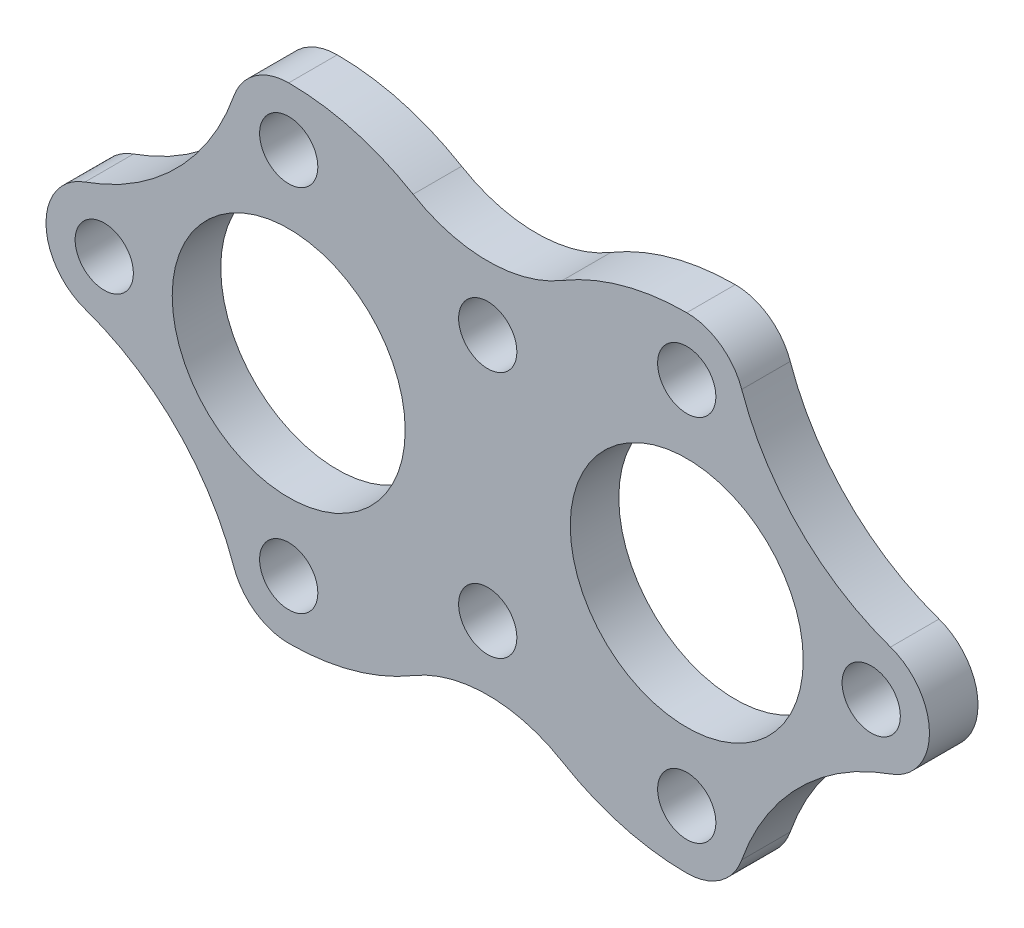
ISO-10303-21;
HEADER;
FILE_DESCRIPTION(('STEP AP214'),'2;1');
FILE_NAME('part.step','',(''),(''),'','','');
FILE_SCHEMA(('AUTOMOTIVE_DESIGN { 1 0 10303 214 1 1 1 1 }'));
ENDSEC;
DATA;
#1=APPLICATION_CONTEXT('core data for automotive mechanical design processes');
#2=APPLICATION_PROTOCOL_DEFINITION('international standard','automotive_design',2000,#1);
#3=PRODUCT_CONTEXT('',#1,'mechanical');
#4=PRODUCT('Part','Part','',(#3));
#5=PRODUCT_RELATED_PRODUCT_CATEGORY('part','',(#4));
#6=PRODUCT_DEFINITION_FORMATION('','',#4);
#7=PRODUCT_DEFINITION_CONTEXT('part definition',#1,'design');
#8=PRODUCT_DEFINITION('design','',#6,#7);
#9=PRODUCT_DEFINITION_SHAPE('','',#8);
#10=(LENGTH_UNIT() NAMED_UNIT(*) SI_UNIT(.MILLI.,.METRE.));
#11=(NAMED_UNIT(*) PLANE_ANGLE_UNIT() SI_UNIT($,.RADIAN.));
#12=(NAMED_UNIT(*) SI_UNIT($,.STERADIAN.) SOLID_ANGLE_UNIT());
#13=UNCERTAINTY_MEASURE_WITH_UNIT(LENGTH_MEASURE(1.E-05),#10,'distance_accuracy_value','');
#14=(GEOMETRIC_REPRESENTATION_CONTEXT(3) GLOBAL_UNCERTAINTY_ASSIGNED_CONTEXT((#13)) GLOBAL_UNIT_ASSIGNED_CONTEXT((#10,
#11,#12)) REPRESENTATION_CONTEXT('',''));
#15=CARTESIAN_POINT('',(0.,0.,0.));
#16=DIRECTION('',(0.,0.,1.));
#17=DIRECTION('',(1.,0.,0.));
#18=AXIS2_PLACEMENT_3D('',#15,#16,#17);
#19=CARTESIAN_POINT('',(-41.,0.,10.));
#20=DIRECTION('',(0.,0.,-1.));
#21=DIRECTION('',(-1.,0.,0.));
#22=AXIS2_PLACEMENT_3D('',#19,#20,#21);
#23=CYLINDRICAL_SURFACE('',#22,50.);
#24=CARTESIAN_POINT('',(-41.,0.,0.));
#25=DIRECTION('',(0.,0.,1.));
#26=DIRECTION('',(1.,0.,0.));
#27=AXIS2_PLACEMENT_3D('',#24,#25,#26);
#28=CIRCLE('',#27,50.);
#29=CARTESIAN_POINT('',(-41.,50.,0.));
#30=VERTEX_POINT('',#29);
#31=CARTESIAN_POINT('',(-15.375,42.934361238989,0.));
#32=VERTEX_POINT('',#31);
#33=EDGE_CURVE('E210',#30,#32,#28,.F.);
#34=ORIENTED_EDGE('',*,*,#33,.F.);
#35=DIRECTION('',(0.,0.,-1.));
#36=VECTOR('',#35,1.);
#37=CARTESIAN_POINT('',(-41.,50.,10.));
#38=LINE('',#37,#36);
#39=CARTESIAN_POINT('',(-41.,50.,10.));
#40=VERTEX_POINT('',#39);
#41=EDGE_CURVE('E11',#40,#30,#38,.T.);
#42=ORIENTED_EDGE('',*,*,#41,.F.);
#43=CARTESIAN_POINT('',(-41.,0.,10.));
#44=DIRECTION('',(0.,0.,1.));
#45=DIRECTION('',(1.,0.,0.));
#46=AXIS2_PLACEMENT_3D('',#43,#44,#45);
#47=CIRCLE('',#46,50.);
#48=CARTESIAN_POINT('',(-15.375,42.934361238989,10.));
#49=VERTEX_POINT('',#48);
#50=EDGE_CURVE('E281',#40,#49,#47,.F.);
#51=ORIENTED_EDGE('',*,*,#50,.T.);
#52=DIRECTION('',(0.,0.,-1.));
#53=VECTOR('',#52,1.);
#54=CARTESIAN_POINT('',(-15.375,42.934361238989,10.));
#55=LINE('',#54,#53);
#56=EDGE_CURVE('E55',#49,#32,#55,.T.);
#57=ORIENTED_EDGE('',*,*,#56,.T.);
#58=EDGE_LOOP('',(#34,#42,#51,#57));
#59=FACE_BOUND('',#58,.T.);
#60=ADVANCED_FACE('F39',(#59),#23,.T.);
#61=CARTESIAN_POINT('',(-41.,38.,10.));
#62=DIRECTION('',(0.,0.,-1.));
#63=DIRECTION('',(-1.,0.,0.));
#64=AXIS2_PLACEMENT_3D('',#61,#62,#63);
#65=CYLINDRICAL_SURFACE('',#64,12.);
#66=CARTESIAN_POINT('',(-41.,38.,0.));
#67=DIRECTION('',(0.,0.,1.));
#68=DIRECTION('',(1.,0.,0.));
#69=AXIS2_PLACEMENT_3D('',#66,#67,#68);
#70=CIRCLE('',#69,12.);
#71=CARTESIAN_POINT('',(-52.3244179090858,41.9695791994084,0.));
#72=VERTEX_POINT('',#71);
#73=EDGE_CURVE('E212',#72,#30,#70,.F.);
#74=ORIENTED_EDGE('',*,*,#73,.F.);
#75=DIRECTION('',(0.,0.,-1.));
#76=VECTOR('',#75,1.);
#77=CARTESIAN_POINT('',(-52.3244179090858,41.9695791994084,10.));
#78=LINE('',#77,#76);
#79=CARTESIAN_POINT('',(-52.3244179090858,41.9695791994084,10.));
#80=VERTEX_POINT('',#79);
#81=EDGE_CURVE('E47',#80,#72,#78,.T.);
#82=ORIENTED_EDGE('',*,*,#81,.F.);
#83=CARTESIAN_POINT('',(-41.,38.,10.));
#84=DIRECTION('',(0.,0.,1.));
#85=DIRECTION('',(1.,0.,0.));
#86=AXIS2_PLACEMENT_3D('',#83,#84,#85);
#87=CIRCLE('',#86,12.);
#88=EDGE_CURVE('E322',#80,#40,#87,.F.);
#89=ORIENTED_EDGE('',*,*,#88,.T.);
#90=ORIENTED_EDGE('',*,*,#41,.T.);
#91=EDGE_LOOP('',(#74,#82,#89,#90));
#92=FACE_BOUND('',#91,.T.);
#93=ADVANCED_FACE('F321',(#92),#65,.T.);
#94=CARTESIAN_POINT('',(-99.5094925302768,58.5094925302768,10.));
#95=DIRECTION('',(0.,0.,-1.));
#96=DIRECTION('',(-1.,0.,0.));
#97=AXIS2_PLACEMENT_3D('',#94,#95,#96);
#98=CYLINDRICAL_SURFACE('',#97,50.);
#99=CARTESIAN_POINT('',(-99.5094925302768,58.5094925302768,0.));
#100=DIRECTION('',(0.,0.,1.));
#101=DIRECTION('',(1.,0.,0.));
#102=AXIS2_PLACEMENT_3D('',#99,#100,#101);
#103=CIRCLE('',#102,50.);
#104=CARTESIAN_POINT('',(-82.9695791994084,11.3244179090858,0.));
#105=VERTEX_POINT('',#104);
#106=EDGE_CURVE('E215',#72,#105,#103,.F.);
#107=ORIENTED_EDGE('',*,*,#106,.T.);
#108=DIRECTION('',(0.,0.,-1.));
#109=VECTOR('',#108,1.);
#110=CARTESIAN_POINT('',(-82.9695791994084,11.3244179090858,10.));
#111=LINE('',#110,#109);
#112=CARTESIAN_POINT('',(-82.9695791994084,11.3244179090858,10.));
#113=VERTEX_POINT('',#112);
#114=EDGE_CURVE('E306',#113,#105,#111,.T.);
#115=ORIENTED_EDGE('',*,*,#114,.F.);
#116=CARTESIAN_POINT('',(-99.5094925302768,58.5094925302768,10.));
#117=DIRECTION('',(0.,0.,1.));
#118=DIRECTION('',(1.,0.,0.));
#119=AXIS2_PLACEMENT_3D('',#116,#117,#118);
#120=CIRCLE('',#119,50.);
#121=EDGE_CURVE('E312',#80,#113,#120,.F.);
#122=ORIENTED_EDGE('',*,*,#121,.F.);
#123=ORIENTED_EDGE('',*,*,#81,.T.);
#124=EDGE_LOOP('',(#107,#115,#122,#123));
#125=FACE_BOUND('',#124,.T.);
#126=ADVANCED_FACE('F310',(#125),#98,.F.);
#127=CARTESIAN_POINT('',(-79.,0.,10.));
#128=DIRECTION('',(0.,0.,-1.));
#129=DIRECTION('',(-1.,0.,0.));
#130=AXIS2_PLACEMENT_3D('',#127,#128,#129);
#131=CYLINDRICAL_SURFACE('',#130,12.);
#132=CARTESIAN_POINT('',(-79.,0.,0.));
#133=DIRECTION('',(0.,0.,1.));
#134=DIRECTION('',(1.,0.,0.));
#135=AXIS2_PLACEMENT_3D('',#132,#133,#134);
#136=CIRCLE('',#135,12.);
#137=CARTESIAN_POINT('',(-82.9695791994084,-11.3244179090858,0.));
#138=VERTEX_POINT('',#137);
#139=EDGE_CURVE('E218',#138,#105,#136,.F.);
#140=ORIENTED_EDGE('',*,*,#139,.F.);
#141=DIRECTION('',(0.,0.,-1.));
#142=VECTOR('',#141,1.);
#143=CARTESIAN_POINT('',(-82.9695791994084,-11.3244179090858,10.));
#144=LINE('',#143,#142);
#145=CARTESIAN_POINT('',(-82.9695791994084,-11.3244179090858,10.));
#146=VERTEX_POINT('',#145);
#147=EDGE_CURVE('E304',#146,#138,#144,.T.);
#148=ORIENTED_EDGE('',*,*,#147,.F.);
#149=CARTESIAN_POINT('',(-79.,0.,10.));
#150=DIRECTION('',(0.,0.,1.));
#151=DIRECTION('',(1.,0.,0.));
#152=AXIS2_PLACEMENT_3D('',#149,#150,#151);
#153=CIRCLE('',#152,12.);
#154=EDGE_CURVE('E665',#146,#113,#153,.F.);
#155=ORIENTED_EDGE('',*,*,#154,.T.);
#156=ORIENTED_EDGE('',*,*,#114,.T.);
#157=EDGE_LOOP('',(#140,#148,#155,#156));
#158=FACE_BOUND('',#157,.T.);
#159=ADVANCED_FACE('F345',(#158),#131,.T.);
#160=CARTESIAN_POINT('',(-99.5094925302768,-58.5094925302768,10.));
#161=DIRECTION('',(0.,0.,-1.));
#162=DIRECTION('',(-1.,0.,0.));
#163=AXIS2_PLACEMENT_3D('',#160,#161,#162);
#164=CYLINDRICAL_SURFACE('',#163,50.);
#165=CARTESIAN_POINT('',(-99.5094925302768,-58.5094925302768,0.));
#166=DIRECTION('',(0.,0.,1.));
#167=DIRECTION('',(1.,0.,0.));
#168=AXIS2_PLACEMENT_3D('',#165,#166,#167);
#169=CIRCLE('',#168,50.);
#170=CARTESIAN_POINT('',(-52.3244179090858,-41.9695791994084,0.));
#171=VERTEX_POINT('',#170);
#172=EDGE_CURVE('E221',#171,#138,#169,.T.);
#173=ORIENTED_EDGE('',*,*,#172,.F.);
#174=DIRECTION('',(0.,0.,-1.));
#175=VECTOR('',#174,1.);
#176=CARTESIAN_POINT('',(-52.3244179090858,-41.9695791994084,10.));
#177=LINE('',#176,#175);
#178=CARTESIAN_POINT('',(-52.3244179090858,-41.9695791994084,10.));
#179=VERTEX_POINT('',#178);
#180=EDGE_CURVE('E302',#179,#171,#177,.T.);
#181=ORIENTED_EDGE('',*,*,#180,.F.);
#182=CARTESIAN_POINT('',(-99.5094925302768,-58.5094925302768,10.));
#183=DIRECTION('',(0.,0.,1.));
#184=DIRECTION('',(1.,0.,0.));
#185=AXIS2_PLACEMENT_3D('',#182,#183,#184);
#186=CIRCLE('',#185,50.);
#187=EDGE_CURVE('E662',#179,#146,#186,.T.);
#188=ORIENTED_EDGE('',*,*,#187,.T.);
#189=ORIENTED_EDGE('',*,*,#147,.T.);
#190=EDGE_LOOP('',(#173,#181,#188,#189));
#191=FACE_BOUND('',#190,.T.);
#192=ADVANCED_FACE('F350',(#191),#164,.F.);
#193=CARTESIAN_POINT('',(-41.,-38.,10.));
#194=DIRECTION('',(0.,0.,-1.));
#195=DIRECTION('',(-1.,0.,0.));
#196=AXIS2_PLACEMENT_3D('',#193,#194,#195);
#197=CYLINDRICAL_SURFACE('',#196,12.);
#198=CARTESIAN_POINT('',(-41.,-38.,0.));
#199=DIRECTION('',(0.,0.,1.));
#200=DIRECTION('',(1.,0.,0.));
#201=AXIS2_PLACEMENT_3D('',#198,#199,#200);
#202=CIRCLE('',#201,12.);
#203=CARTESIAN_POINT('',(-41.,-50.,0.));
#204=VERTEX_POINT('',#203);
#205=EDGE_CURVE('E224',#171,#204,#202,.T.);
#206=ORIENTED_EDGE('',*,*,#205,.T.);
#207=DIRECTION('',(0.,0.,-1.));
#208=VECTOR('',#207,1.);
#209=CARTESIAN_POINT('',(-41.,-50.,10.));
#210=LINE('',#209,#208);
#211=CARTESIAN_POINT('',(-41.,-50.,10.));
#212=VERTEX_POINT('',#211);
#213=EDGE_CURVE('E299',#212,#204,#210,.T.);
#214=ORIENTED_EDGE('',*,*,#213,.F.);
#215=CARTESIAN_POINT('',(-41.,-38.,10.));
#216=DIRECTION('',(0.,0.,1.));
#217=DIRECTION('',(1.,0.,0.));
#218=AXIS2_PLACEMENT_3D('',#215,#216,#217);
#219=CIRCLE('',#218,12.);
#220=EDGE_CURVE('E667',#179,#212,#219,.T.);
#221=ORIENTED_EDGE('',*,*,#220,.F.);
#222=ORIENTED_EDGE('',*,*,#180,.T.);
#223=EDGE_LOOP('',(#206,#214,#221,#222));
#224=FACE_BOUND('',#223,.T.);
#225=ADVANCED_FACE('F354',(#224),#197,.T.);
#226=CARTESIAN_POINT('',(-41.,0.,10.));
#227=DIRECTION('',(0.,0.,-1.));
#228=DIRECTION('',(-1.,0.,0.));
#229=AXIS2_PLACEMENT_3D('',#226,#227,#228);
#230=CYLINDRICAL_SURFACE('',#229,50.);
#231=CARTESIAN_POINT('',(-41.,0.,0.));
#232=DIRECTION('',(0.,0.,1.));
#233=DIRECTION('',(1.,0.,0.));
#234=AXIS2_PLACEMENT_3D('',#231,#232,#233);
#235=CIRCLE('',#234,50.);
#236=CARTESIAN_POINT('',(-15.375,-42.934361238989,0.));
#237=VERTEX_POINT('',#236);
#238=EDGE_CURVE('E226',#204,#237,#235,.T.);
#239=ORIENTED_EDGE('',*,*,#238,.T.);
#240=DIRECTION('',(0.,0.,-1.));
#241=VECTOR('',#240,1.);
#242=CARTESIAN_POINT('',(-15.375,-42.934361238989,10.));
#243=LINE('',#242,#241);
#244=CARTESIAN_POINT('',(-15.375,-42.934361238989,10.));
#245=VERTEX_POINT('',#244);
#246=EDGE_CURVE('E296',#245,#237,#243,.T.);
#247=ORIENTED_EDGE('',*,*,#246,.F.);
#248=CARTESIAN_POINT('',(-41.,0.,10.));
#249=DIRECTION('',(0.,0.,1.));
#250=DIRECTION('',(1.,0.,0.));
#251=AXIS2_PLACEMENT_3D('',#248,#249,#250);
#252=CIRCLE('',#251,50.);
#253=EDGE_CURVE('E655',#212,#245,#252,.T.);
#254=ORIENTED_EDGE('',*,*,#253,.F.);
#255=ORIENTED_EDGE('',*,*,#213,.T.);
#256=EDGE_LOOP('',(#239,#247,#254,#255));
#257=FACE_BOUND('',#256,.T.);
#258=ADVANCED_FACE('F358',(#257),#230,.T.);
#259=CARTESIAN_POINT('',(0.,-68.6949779823824,10.));
#260=DIRECTION('',(0.,0.,-1.));
#261=DIRECTION('',(-1.,0.,0.));
#262=AXIS2_PLACEMENT_3D('',#259,#260,#261);
#263=CYLINDRICAL_SURFACE('',#262,30.);
#264=CARTESIAN_POINT('',(0.,-68.6949779823824,0.));
#265=DIRECTION('',(0.,0.,1.));
#266=DIRECTION('',(1.,0.,0.));
#267=AXIS2_PLACEMENT_3D('',#264,#265,#266);
#268=CIRCLE('',#267,30.);
#269=CARTESIAN_POINT('',(15.375,-42.934361238989,0.));
#270=VERTEX_POINT('',#269);
#271=EDGE_CURVE('E228',#237,#270,#268,.F.);
#272=ORIENTED_EDGE('',*,*,#271,.T.);
#273=DIRECTION('',(0.,0.,-1.));
#274=VECTOR('',#273,1.);
#275=CARTESIAN_POINT('',(15.375,-42.934361238989,10.));
#276=LINE('',#275,#274);
#277=CARTESIAN_POINT('',(15.375,-42.934361238989,10.));
#278=VERTEX_POINT('',#277);
#279=EDGE_CURVE('E294',#278,#270,#276,.T.);
#280=ORIENTED_EDGE('',*,*,#279,.F.);
#281=CARTESIAN_POINT('',(0.,-68.6949779823824,10.));
#282=DIRECTION('',(0.,0.,1.));
#283=DIRECTION('',(1.,0.,0.));
#284=AXIS2_PLACEMENT_3D('',#281,#282,#283);
#285=CIRCLE('',#284,30.);
#286=EDGE_CURVE('E653',#245,#278,#285,.F.);
#287=ORIENTED_EDGE('',*,*,#286,.F.);
#288=ORIENTED_EDGE('',*,*,#246,.T.);
#289=EDGE_LOOP('',(#272,#280,#287,#288));
#290=FACE_BOUND('',#289,.T.);
#291=ADVANCED_FACE('F362',(#290),#263,.F.);
#292=CARTESIAN_POINT('',(41.,0.,10.));
#293=DIRECTION('',(0.,0.,-1.));
#294=DIRECTION('',(-1.,0.,0.));
#295=AXIS2_PLACEMENT_3D('',#292,#293,#294);
#296=CYLINDRICAL_SURFACE('',#295,50.);
#297=CARTESIAN_POINT('',(41.,0.,0.));
#298=DIRECTION('',(0.,0.,1.));
#299=DIRECTION('',(1.,0.,0.));
#300=AXIS2_PLACEMENT_3D('',#297,#298,#299);
#301=CIRCLE('',#300,50.);
#302=CARTESIAN_POINT('',(41.,-50.,0.));
#303=VERTEX_POINT('',#302);
#304=EDGE_CURVE('E231',#303,#270,#301,.F.);
#305=ORIENTED_EDGE('',*,*,#304,.F.);
#306=DIRECTION('',(0.,0.,-1.));
#307=VECTOR('',#306,1.);
#308=CARTESIAN_POINT('',(41.,-50.,10.));
#309=LINE('',#308,#307);
#310=CARTESIAN_POINT('',(41.,-50.,10.));
#311=VERTEX_POINT('',#310);
#312=EDGE_CURVE('E292',#311,#303,#309,.T.);
#313=ORIENTED_EDGE('',*,*,#312,.F.);
#314=CARTESIAN_POINT('',(41.,0.,10.));
#315=DIRECTION('',(0.,0.,1.));
#316=DIRECTION('',(1.,0.,0.));
#317=AXIS2_PLACEMENT_3D('',#314,#315,#316);
#318=CIRCLE('',#317,50.);
#319=EDGE_CURVE('E650',#311,#278,#318,.F.);
#320=ORIENTED_EDGE('',*,*,#319,.T.);
#321=ORIENTED_EDGE('',*,*,#279,.T.);
#322=EDGE_LOOP('',(#305,#313,#320,#321));
#323=FACE_BOUND('',#322,.T.);
#324=ADVANCED_FACE('F366',(#323),#296,.T.);
#325=CARTESIAN_POINT('',(41.,-38.,10.));
#326=DIRECTION('',(0.,0.,-1.));
#327=DIRECTION('',(-1.,0.,0.));
#328=AXIS2_PLACEMENT_3D('',#325,#326,#327);
#329=CYLINDRICAL_SURFACE('',#328,12.);
#330=CARTESIAN_POINT('',(41.,-38.,0.));
#331=DIRECTION('',(0.,0.,1.));
#332=DIRECTION('',(1.,0.,0.));
#333=AXIS2_PLACEMENT_3D('',#330,#331,#332);
#334=CIRCLE('',#333,12.);
#335=CARTESIAN_POINT('',(52.3244179090858,-41.9695791994084,0.));
#336=VERTEX_POINT('',#335);
#337=EDGE_CURVE('E234',#336,#303,#334,.F.);
#338=ORIENTED_EDGE('',*,*,#337,.F.);
#339=DIRECTION('',(0.,0.,-1.));
#340=VECTOR('',#339,1.);
#341=CARTESIAN_POINT('',(52.3244179090858,-41.9695791994084,10.));
#342=LINE('',#341,#340);
#343=CARTESIAN_POINT('',(52.3244179090858,-41.9695791994084,10.));
#344=VERTEX_POINT('',#343);
#345=EDGE_CURVE('E290',#344,#336,#342,.T.);
#346=ORIENTED_EDGE('',*,*,#345,.F.);
#347=CARTESIAN_POINT('',(41.,-38.,10.));
#348=DIRECTION('',(0.,0.,1.));
#349=DIRECTION('',(1.,0.,0.));
#350=AXIS2_PLACEMENT_3D('',#347,#348,#349);
#351=CIRCLE('',#350,12.);
#352=EDGE_CURVE('E643',#344,#311,#351,.F.);
#353=ORIENTED_EDGE('',*,*,#352,.T.);
#354=ORIENTED_EDGE('',*,*,#312,.T.);
#355=EDGE_LOOP('',(#338,#346,#353,#354));
#356=FACE_BOUND('',#355,.T.);
#357=ADVANCED_FACE('F370',(#356),#329,.T.);
#358=CARTESIAN_POINT('',(99.5094925302768,-58.5094925302768,10.));
#359=DIRECTION('',(0.,0.,-1.));
#360=DIRECTION('',(-1.,0.,0.));
#361=AXIS2_PLACEMENT_3D('',#358,#359,#360);
#362=CYLINDRICAL_SURFACE('',#361,50.);
#363=CARTESIAN_POINT('',(99.5094925302768,-58.5094925302768,0.));
#364=DIRECTION('',(0.,0.,1.));
#365=DIRECTION('',(1.,0.,0.));
#366=AXIS2_PLACEMENT_3D('',#363,#364,#365);
#367=CIRCLE('',#366,50.);
#368=CARTESIAN_POINT('',(82.9695791994084,-11.3244179090858,0.));
#369=VERTEX_POINT('',#368);
#370=EDGE_CURVE('E237',#336,#369,#367,.F.);
#371=ORIENTED_EDGE('',*,*,#370,.T.);
#372=DIRECTION('',(0.,0.,-1.));
#373=VECTOR('',#372,1.);
#374=CARTESIAN_POINT('',(82.9695791994084,-11.3244179090858,10.));
#375=LINE('',#374,#373);
#376=CARTESIAN_POINT('',(82.9695791994084,-11.3244179090858,10.));
#377=VERTEX_POINT('',#376);
#378=EDGE_CURVE('E287',#377,#369,#375,.T.);
#379=ORIENTED_EDGE('',*,*,#378,.F.);
#380=CARTESIAN_POINT('',(99.5094925302768,-58.5094925302768,10.));
#381=DIRECTION('',(0.,0.,1.));
#382=DIRECTION('',(1.,0.,0.));
#383=AXIS2_PLACEMENT_3D('',#380,#381,#382);
#384=CIRCLE('',#383,50.);
#385=EDGE_CURVE('E640',#344,#377,#384,.F.);
#386=ORIENTED_EDGE('',*,*,#385,.F.);
#387=ORIENTED_EDGE('',*,*,#345,.T.);
#388=EDGE_LOOP('',(#371,#379,#386,#387));
#389=FACE_BOUND('',#388,.T.);
#390=ADVANCED_FACE('F374',(#389),#362,.F.);
#391=CARTESIAN_POINT('',(79.,0.,10.));
#392=DIRECTION('',(0.,0.,-1.));
#393=DIRECTION('',(-1.,0.,0.));
#394=AXIS2_PLACEMENT_3D('',#391,#392,#393);
#395=CYLINDRICAL_SURFACE('',#394,12.);
#396=CARTESIAN_POINT('',(79.,0.,0.));
#397=DIRECTION('',(0.,0.,1.));
#398=DIRECTION('',(1.,0.,0.));
#399=AXIS2_PLACEMENT_3D('',#396,#397,#398);
#400=CIRCLE('',#399,12.);
#401=CARTESIAN_POINT('',(82.9695791994084,11.3244179090858,0.));
#402=VERTEX_POINT('',#401);
#403=EDGE_CURVE('E239',#369,#402,#400,.T.);
#404=ORIENTED_EDGE('',*,*,#403,.T.);
#405=DIRECTION('',(0.,0.,-1.));
#406=VECTOR('',#405,1.);
#407=CARTESIAN_POINT('',(82.9695791994084,11.3244179090858,10.));
#408=LINE('',#407,#406);
#409=CARTESIAN_POINT('',(82.9695791994084,11.3244179090858,10.));
#410=VERTEX_POINT('',#409);
#411=EDGE_CURVE('E285',#410,#402,#408,.T.);
#412=ORIENTED_EDGE('',*,*,#411,.F.);
#413=CARTESIAN_POINT('',(79.,0.,10.));
#414=DIRECTION('',(0.,0.,1.));
#415=DIRECTION('',(1.,0.,0.));
#416=AXIS2_PLACEMENT_3D('',#413,#414,#415);
#417=CIRCLE('',#416,12.);
#418=EDGE_CURVE('E638',#377,#410,#417,.T.);
#419=ORIENTED_EDGE('',*,*,#418,.F.);
#420=ORIENTED_EDGE('',*,*,#378,.T.);
#421=EDGE_LOOP('',(#404,#412,#419,#420));
#422=FACE_BOUND('',#421,.T.);
#423=ADVANCED_FACE('F378',(#422),#395,.T.);
#424=CARTESIAN_POINT('',(99.5094925302768,58.5094925302768,10.));
#425=DIRECTION('',(0.,0.,-1.));
#426=DIRECTION('',(-1.,0.,0.));
#427=AXIS2_PLACEMENT_3D('',#424,#425,#426);
#428=CYLINDRICAL_SURFACE('',#427,50.);
#429=CARTESIAN_POINT('',(99.5094925302768,58.5094925302768,0.));
#430=DIRECTION('',(0.,0.,1.));
#431=DIRECTION('',(1.,0.,0.));
#432=AXIS2_PLACEMENT_3D('',#429,#430,#431);
#433=CIRCLE('',#432,50.);
#434=CARTESIAN_POINT('',(52.3244179090858,41.9695791994084,0.));
#435=VERTEX_POINT('',#434);
#436=EDGE_CURVE('E242',#435,#402,#433,.T.);
#437=ORIENTED_EDGE('',*,*,#436,.F.);
#438=DIRECTION('',(0.,0.,-1.));
#439=VECTOR('',#438,1.);
#440=CARTESIAN_POINT('',(52.3244179090858,41.9695791994084,10.));
#441=LINE('',#440,#439);
#442=CARTESIAN_POINT('',(52.3244179090858,41.9695791994084,10.));
#443=VERTEX_POINT('',#442);
#444=EDGE_CURVE('E172',#443,#435,#441,.T.);
#445=ORIENTED_EDGE('',*,*,#444,.F.);
#446=CARTESIAN_POINT('',(99.5094925302768,58.5094925302768,10.));
#447=DIRECTION('',(0.,0.,1.));
#448=DIRECTION('',(1.,0.,0.));
#449=AXIS2_PLACEMENT_3D('',#446,#447,#448);
#450=CIRCLE('',#449,50.);
#451=EDGE_CURVE('E162',#443,#410,#450,.T.);
#452=ORIENTED_EDGE('',*,*,#451,.T.);
#453=ORIENTED_EDGE('',*,*,#411,.T.);
#454=EDGE_LOOP('',(#437,#445,#452,#453));
#455=FACE_BOUND('',#454,.T.);
#456=ADVANCED_FACE('F382',(#455),#428,.F.);
#457=CARTESIAN_POINT('',(41.,38.,10.));
#458=DIRECTION('',(0.,0.,-1.));
#459=DIRECTION('',(-1.,0.,0.));
#460=AXIS2_PLACEMENT_3D('',#457,#458,#459);
#461=CYLINDRICAL_SURFACE('',#460,12.);
#462=CARTESIAN_POINT('',(41.,38.,0.));
#463=DIRECTION('',(0.,0.,1.));
#464=DIRECTION('',(1.,0.,0.));
#465=AXIS2_PLACEMENT_3D('',#462,#463,#464);
#466=CIRCLE('',#465,12.);
#467=CARTESIAN_POINT('',(41.,50.,0.));
#468=VERTEX_POINT('',#467);
#469=EDGE_CURVE('E169',#435,#468,#466,.T.);
#470=ORIENTED_EDGE('',*,*,#469,.T.);
#471=DIRECTION('',(0.,0.,-1.));
#472=VECTOR('',#471,1.);
#473=CARTESIAN_POINT('',(41.,50.,10.));
#474=LINE('',#473,#472);
#475=CARTESIAN_POINT('',(41.,50.,10.));
#476=VERTEX_POINT('',#475);
#477=EDGE_CURVE('E166',#476,#468,#474,.T.);
#478=ORIENTED_EDGE('',*,*,#477,.F.);
#479=CARTESIAN_POINT('',(41.,38.,10.));
#480=DIRECTION('',(0.,0.,1.));
#481=DIRECTION('',(1.,0.,0.));
#482=AXIS2_PLACEMENT_3D('',#479,#480,#481);
#483=CIRCLE('',#482,12.);
#484=EDGE_CURVE('E154',#443,#476,#483,.T.);
#485=ORIENTED_EDGE('',*,*,#484,.F.);
#486=ORIENTED_EDGE('',*,*,#444,.T.);
#487=EDGE_LOOP('',(#470,#478,#485,#486));
#488=FACE_BOUND('',#487,.T.);
#489=ADVANCED_FACE('F167',(#488),#461,.T.);
#490=CARTESIAN_POINT('',(41.,0.,10.));
#491=DIRECTION('',(0.,0.,-1.));
#492=DIRECTION('',(-1.,0.,0.));
#493=AXIS2_PLACEMENT_3D('',#490,#491,#492);
#494=CYLINDRICAL_SURFACE('',#493,50.);
#495=CARTESIAN_POINT('',(41.,0.,0.));
#496=DIRECTION('',(0.,0.,1.));
#497=DIRECTION('',(1.,0.,0.));
#498=AXIS2_PLACEMENT_3D('',#495,#496,#497);
#499=CIRCLE('',#498,50.);
#500=CARTESIAN_POINT('',(15.375,42.934361238989,0.));
#501=VERTEX_POINT('',#500);
#502=EDGE_CURVE('E246',#468,#501,#499,.T.);
#503=ORIENTED_EDGE('',*,*,#502,.T.);
#504=DIRECTION('',(0.,0.,-1.));
#505=VECTOR('',#504,1.);
#506=CARTESIAN_POINT('',(15.375,42.934361238989,10.));
#507=LINE('',#506,#505);
#508=CARTESIAN_POINT('',(15.375,42.934361238989,10.));
#509=VERTEX_POINT('',#508);
#510=EDGE_CURVE('E105',#509,#501,#507,.T.);
#511=ORIENTED_EDGE('',*,*,#510,.F.);
#512=CARTESIAN_POINT('',(41.,0.,10.));
#513=DIRECTION('',(0.,0.,1.));
#514=DIRECTION('',(1.,0.,0.));
#515=AXIS2_PLACEMENT_3D('',#512,#513,#514);
#516=CIRCLE('',#515,50.);
#517=EDGE_CURVE('E160',#476,#509,#516,.T.);
#518=ORIENTED_EDGE('',*,*,#517,.F.);
#519=ORIENTED_EDGE('',*,*,#477,.T.);
#520=EDGE_LOOP('',(#503,#511,#518,#519));
#521=FACE_BOUND('',#520,.T.);
#522=ADVANCED_FACE('F174',(#521),#494,.T.);
#523=CARTESIAN_POINT('',(-41.,-38.,10.));
#524=DIRECTION('',(0.,0.,-1.));
#525=DIRECTION('',(-1.,0.,0.));
#526=AXIS2_PLACEMENT_3D('',#523,#524,#525);
#527=CYLINDRICAL_SURFACE('',#526,6.);
#528=CARTESIAN_POINT('',(-41.,-38.,10.));
#529=DIRECTION('',(0.,0.,1.));
#530=DIRECTION('',(1.,0.,0.));
#531=AXIS2_PLACEMENT_3D('',#528,#529,#530);
#532=CIRCLE('',#531,6.);
#533=CARTESIAN_POINT('',(-35.,-38.,10.));
#534=VERTEX_POINT('',#533);
#535=EDGE_CURVE('E204',#534,#534,#532,.F.);
#536=ORIENTED_EDGE('',*,*,#535,.F.);
#537=EDGE_LOOP('',(#536));
#538=FACE_BOUND('',#537,.T.);
#539=CARTESIAN_POINT('',(-41.,-38.,0.));
#540=DIRECTION('',(0.,0.,1.));
#541=DIRECTION('',(1.,0.,0.));
#542=AXIS2_PLACEMENT_3D('',#539,#540,#541);
#543=CIRCLE('',#542,6.);
#544=CARTESIAN_POINT('',(-35.,-38.,0.));
#545=VERTEX_POINT('',#544);
#546=EDGE_CURVE('E275',#545,#545,#543,.F.);
#547=ORIENTED_EDGE('',*,*,#546,.T.);
#548=EDGE_LOOP('',(#547));
#549=FACE_BOUND('',#548,.T.);
#550=ADVANCED_FACE('F389',(#538,#549),#527,.F.);
#551=CARTESIAN_POINT('',(0.,-25.5,10.));
#552=DIRECTION('',(0.,0.,-1.));
#553=DIRECTION('',(-1.,0.,0.));
#554=AXIS2_PLACEMENT_3D('',#551,#552,#553);
#555=CYLINDRICAL_SURFACE('',#554,6.);
#556=CARTESIAN_POINT('',(0.,-25.5,10.));
#557=DIRECTION('',(0.,0.,1.));
#558=DIRECTION('',(1.,0.,0.));
#559=AXIS2_PLACEMENT_3D('',#556,#557,#558);
#560=CIRCLE('',#559,6.);
#561=CARTESIAN_POINT('',(6.,-25.5,10.));
#562=VERTEX_POINT('',#561);
#563=EDGE_CURVE('E201',#562,#562,#560,.F.);
#564=ORIENTED_EDGE('',*,*,#563,.F.);
#565=EDGE_LOOP('',(#564));
#566=FACE_BOUND('',#565,.T.);
#567=CARTESIAN_POINT('',(0.,-25.5,0.));
#568=DIRECTION('',(0.,0.,1.));
#569=DIRECTION('',(1.,0.,0.));
#570=AXIS2_PLACEMENT_3D('',#567,#568,#569);
#571=CIRCLE('',#570,6.);
#572=CARTESIAN_POINT('',(6.,-25.5,0.));
#573=VERTEX_POINT('',#572);
#574=EDGE_CURVE('E272',#573,#573,#571,.F.);
#575=ORIENTED_EDGE('',*,*,#574,.T.);
#576=EDGE_LOOP('',(#575));
#577=FACE_BOUND('',#576,.T.);
#578=ADVANCED_FACE('F393',(#566,#577),#555,.F.);
#579=CARTESIAN_POINT('',(0.,25.5,10.));
#580=DIRECTION('',(0.,0.,-1.));
#581=DIRECTION('',(-1.,0.,0.));
#582=AXIS2_PLACEMENT_3D('',#579,#580,#581);
#583=CYLINDRICAL_SURFACE('',#582,6.);
#584=CARTESIAN_POINT('',(0.,25.5,10.));
#585=DIRECTION('',(0.,0.,1.));
#586=DIRECTION('',(1.,0.,0.));
#587=AXIS2_PLACEMENT_3D('',#584,#585,#586);
#588=CIRCLE('',#587,6.);
#589=CARTESIAN_POINT('',(6.,25.5,10.));
#590=VERTEX_POINT('',#589);
#591=EDGE_CURVE('E198',#590,#590,#588,.T.);
#592=ORIENTED_EDGE('',*,*,#591,.T.);
#593=EDGE_LOOP('',(#592));
#594=FACE_BOUND('',#593,.T.);
#595=CARTESIAN_POINT('',(0.,25.5,0.));
#596=DIRECTION('',(0.,0.,1.));
#597=DIRECTION('',(1.,0.,0.));
#598=AXIS2_PLACEMENT_3D('',#595,#596,#597);
#599=CIRCLE('',#598,6.);
#600=CARTESIAN_POINT('',(6.,25.5,0.));
#601=VERTEX_POINT('',#600);
#602=EDGE_CURVE('E269',#601,#601,#599,.T.);
#603=ORIENTED_EDGE('',*,*,#602,.F.);
#604=EDGE_LOOP('',(#603));
#605=FACE_BOUND('',#604,.T.);
#606=ADVANCED_FACE('F399',(#594,#605),#583,.F.);
#607=CARTESIAN_POINT('',(41.,38.,10.));
#608=DIRECTION('',(0.,0.,-1.));
#609=DIRECTION('',(-1.,0.,0.));
#610=AXIS2_PLACEMENT_3D('',#607,#608,#609);
#611=CYLINDRICAL_SURFACE('',#610,6.);
#612=CARTESIAN_POINT('',(41.,38.,10.));
#613=DIRECTION('',(0.,0.,1.));
#614=DIRECTION('',(1.,0.,0.));
#615=AXIS2_PLACEMENT_3D('',#612,#613,#614);
#616=CIRCLE('',#615,6.);
#617=CARTESIAN_POINT('',(47.,38.,10.));
#618=VERTEX_POINT('',#617);
#619=EDGE_CURVE('E195',#618,#618,#616,.T.);
#620=ORIENTED_EDGE('',*,*,#619,.T.);
#621=EDGE_LOOP('',(#620));
#622=FACE_BOUND('',#621,.T.);
#623=CARTESIAN_POINT('',(41.,38.,0.));
#624=DIRECTION('',(0.,0.,1.));
#625=DIRECTION('',(1.,0.,0.));
#626=AXIS2_PLACEMENT_3D('',#623,#624,#625);
#627=CIRCLE('',#626,6.);
#628=CARTESIAN_POINT('',(47.,38.,0.));
#629=VERTEX_POINT('',#628);
#630=EDGE_CURVE('E266',#629,#629,#627,.T.);
#631=ORIENTED_EDGE('',*,*,#630,.F.);
#632=EDGE_LOOP('',(#631));
#633=FACE_BOUND('',#632,.T.);
#634=ADVANCED_FACE('F408',(#622,#633),#611,.F.);
#635=CARTESIAN_POINT('',(41.,-38.,10.));
#636=DIRECTION('',(0.,0.,-1.));
#637=DIRECTION('',(-1.,0.,0.));
#638=AXIS2_PLACEMENT_3D('',#635,#636,#637);
#639=CYLINDRICAL_SURFACE('',#638,6.);
#640=CARTESIAN_POINT('',(41.,-38.,10.));
#641=DIRECTION('',(0.,0.,1.));
#642=DIRECTION('',(1.,0.,0.));
#643=AXIS2_PLACEMENT_3D('',#640,#641,#642);
#644=CIRCLE('',#643,6.);
#645=CARTESIAN_POINT('',(47.,-38.,10.));
#646=VERTEX_POINT('',#645);
#647=EDGE_CURVE('E192',#646,#646,#644,.T.);
#648=ORIENTED_EDGE('',*,*,#647,.T.);
#649=EDGE_LOOP('',(#648));
#650=FACE_BOUND('',#649,.T.);
#651=CARTESIAN_POINT('',(41.,-38.,0.));
#652=DIRECTION('',(0.,0.,1.));
#653=DIRECTION('',(1.,0.,0.));
#654=AXIS2_PLACEMENT_3D('',#651,#652,#653);
#655=CIRCLE('',#654,6.);
#656=CARTESIAN_POINT('',(47.,-38.,0.));
#657=VERTEX_POINT('',#656);
#658=EDGE_CURVE('E263',#657,#657,#655,.T.);
#659=ORIENTED_EDGE('',*,*,#658,.F.);
#660=EDGE_LOOP('',(#659));
#661=FACE_BOUND('',#660,.T.);
#662=ADVANCED_FACE('F412',(#650,#661),#639,.F.);
#663=CARTESIAN_POINT('',(79.,0.,10.));
#664=DIRECTION('',(0.,0.,-1.));
#665=DIRECTION('',(-1.,0.,0.));
#666=AXIS2_PLACEMENT_3D('',#663,#664,#665);
#667=CYLINDRICAL_SURFACE('',#666,6.);
#668=CARTESIAN_POINT('',(79.,0.,10.));
#669=DIRECTION('',(0.,0.,1.));
#670=DIRECTION('',(1.,0.,0.));
#671=AXIS2_PLACEMENT_3D('',#668,#669,#670);
#672=CIRCLE('',#671,6.);
#673=CARTESIAN_POINT('',(85.,0.,10.));
#674=VERTEX_POINT('',#673);
#675=EDGE_CURVE('E189',#674,#674,#672,.T.);
#676=ORIENTED_EDGE('',*,*,#675,.T.);
#677=EDGE_LOOP('',(#676));
#678=FACE_BOUND('',#677,.T.);
#679=CARTESIAN_POINT('',(79.,0.,0.));
#680=DIRECTION('',(0.,0.,1.));
#681=DIRECTION('',(1.,0.,0.));
#682=AXIS2_PLACEMENT_3D('',#679,#680,#681);
#683=CIRCLE('',#682,6.);
#684=CARTESIAN_POINT('',(85.,0.,0.));
#685=VERTEX_POINT('',#684);
#686=EDGE_CURVE('E260',#685,#685,#683,.T.);
#687=ORIENTED_EDGE('',*,*,#686,.F.);
#688=EDGE_LOOP('',(#687));
#689=FACE_BOUND('',#688,.T.);
#690=ADVANCED_FACE('F416',(#678,#689),#667,.F.);
#691=CARTESIAN_POINT('',(41.,0.,10.));
#692=DIRECTION('',(0.,0.,-1.));
#693=DIRECTION('',(-1.,0.,0.));
#694=AXIS2_PLACEMENT_3D('',#691,#692,#693);
#695=CYLINDRICAL_SURFACE('',#694,24.);
#696=CARTESIAN_POINT('',(41.,0.,10.));
#697=DIRECTION('',(0.,0.,1.));
#698=DIRECTION('',(1.,0.,0.));
#699=AXIS2_PLACEMENT_3D('',#696,#697,#698);
#700=CIRCLE('',#699,24.);
#701=CARTESIAN_POINT('',(65.,0.,10.));
#702=VERTEX_POINT('',#701);
#703=EDGE_CURVE('E186',#702,#702,#700,.T.);
#704=ORIENTED_EDGE('',*,*,#703,.T.);
#705=EDGE_LOOP('',(#704));
#706=FACE_BOUND('',#705,.T.);
#707=CARTESIAN_POINT('',(41.,0.,0.));
#708=DIRECTION('',(0.,0.,1.));
#709=DIRECTION('',(1.,0.,0.));
#710=AXIS2_PLACEMENT_3D('',#707,#708,#709);
#711=CIRCLE('',#710,24.);
#712=CARTESIAN_POINT('',(65.,0.,0.));
#713=VERTEX_POINT('',#712);
#714=EDGE_CURVE('E257',#713,#713,#711,.T.);
#715=ORIENTED_EDGE('',*,*,#714,.F.);
#716=EDGE_LOOP('',(#715));
#717=FACE_BOUND('',#716,.T.);
#718=ADVANCED_FACE('F420',(#706,#717),#695,.F.);
#719=CARTESIAN_POINT('',(-41.,0.,10.));
#720=DIRECTION('',(0.,0.,-1.));
#721=DIRECTION('',(-1.,0.,0.));
#722=AXIS2_PLACEMENT_3D('',#719,#720,#721);
#723=CYLINDRICAL_SURFACE('',#722,24.);
#724=CARTESIAN_POINT('',(-41.,0.,10.));
#725=DIRECTION('',(0.,0.,1.));
#726=DIRECTION('',(1.,0.,0.));
#727=AXIS2_PLACEMENT_3D('',#724,#725,#726);
#728=CIRCLE('',#727,24.);
#729=CARTESIAN_POINT('',(-17.,0.,10.));
#730=VERTEX_POINT('',#729);
#731=EDGE_CURVE('E183',#730,#730,#728,.F.);
#732=ORIENTED_EDGE('',*,*,#731,.F.);
#733=EDGE_LOOP('',(#732));
#734=FACE_BOUND('',#733,.T.);
#735=CARTESIAN_POINT('',(-41.,0.,0.));
#736=DIRECTION('',(0.,0.,1.));
#737=DIRECTION('',(1.,0.,0.));
#738=AXIS2_PLACEMENT_3D('',#735,#736,#737);
#739=CIRCLE('',#738,24.);
#740=CARTESIAN_POINT('',(-17.,0.,0.));
#741=VERTEX_POINT('',#740);
#742=EDGE_CURVE('E254',#741,#741,#739,.F.);
#743=ORIENTED_EDGE('',*,*,#742,.T.);
#744=EDGE_LOOP('',(#743));
#745=FACE_BOUND('',#744,.T.);
#746=ADVANCED_FACE('F334',(#734,#745),#723,.F.);
#747=CARTESIAN_POINT('',(-79.,0.,10.));
#748=DIRECTION('',(0.,0.,-1.));
#749=DIRECTION('',(-1.,0.,0.));
#750=AXIS2_PLACEMENT_3D('',#747,#748,#749);
#751=CYLINDRICAL_SURFACE('',#750,6.);
#752=CARTESIAN_POINT('',(-79.,0.,10.));
#753=DIRECTION('',(0.,0.,1.));
#754=DIRECTION('',(1.,0.,0.));
#755=AXIS2_PLACEMENT_3D('',#752,#753,#754);
#756=CIRCLE('',#755,6.);
#757=CARTESIAN_POINT('',(-73.,0.,10.));
#758=VERTEX_POINT('',#757);
#759=EDGE_CURVE('E177',#758,#758,#756,.F.);
#760=ORIENTED_EDGE('',*,*,#759,.F.);
#761=EDGE_LOOP('',(#760));
#762=FACE_BOUND('',#761,.T.);
#763=CARTESIAN_POINT('',(-79.,0.,0.));
#764=DIRECTION('',(0.,0.,1.));
#765=DIRECTION('',(1.,0.,0.));
#766=AXIS2_PLACEMENT_3D('',#763,#764,#765);
#767=CIRCLE('',#766,6.);
#768=CARTESIAN_POINT('',(-73.,0.,0.));
#769=VERTEX_POINT('',#768);
#770=EDGE_CURVE('E251',#769,#769,#767,.F.);
#771=ORIENTED_EDGE('',*,*,#770,.T.);
#772=EDGE_LOOP('',(#771));
#773=FACE_BOUND('',#772,.T.);
#774=ADVANCED_FACE('F326',(#762,#773),#751,.F.);
#775=CARTESIAN_POINT('',(0.,68.6949779823824,10.));
#776=DIRECTION('',(0.,0.,-1.));
#777=DIRECTION('',(-1.,0.,0.));
#778=AXIS2_PLACEMENT_3D('',#775,#776,#777);
#779=CYLINDRICAL_SURFACE('',#778,30.);
#780=CARTESIAN_POINT('',(0.,68.6949779823824,0.));
#781=DIRECTION('',(0.,0.,1.));
#782=DIRECTION('',(1.,0.,0.));
#783=AXIS2_PLACEMENT_3D('',#780,#781,#782);
#784=CIRCLE('',#783,30.);
#785=EDGE_CURVE('E248',#32,#501,#784,.T.);
#786=ORIENTED_EDGE('',*,*,#785,.F.);
#787=ORIENTED_EDGE('',*,*,#56,.F.);
#788=CARTESIAN_POINT('',(0.,68.6949779823824,10.));
#789=DIRECTION('',(0.,0.,1.));
#790=DIRECTION('',(1.,0.,0.));
#791=AXIS2_PLACEMENT_3D('',#788,#789,#790);
#792=CIRCLE('',#791,30.);
#793=EDGE_CURVE('E175',#49,#509,#792,.T.);
#794=ORIENTED_EDGE('',*,*,#793,.T.);
#795=ORIENTED_EDGE('',*,*,#510,.T.);
#796=EDGE_LOOP('',(#786,#787,#794,#795));
#797=FACE_BOUND('',#796,.T.);
#798=ADVANCED_FACE('F323',(#797),#779,.F.);
#799=CARTESIAN_POINT('',(-41.,38.,10.));
#800=DIRECTION('',(0.,0.,-1.));
#801=DIRECTION('',(-1.,0.,0.));
#802=AXIS2_PLACEMENT_3D('',#799,#800,#801);
#803=CYLINDRICAL_SURFACE('',#802,6.);
#804=CARTESIAN_POINT('',(-41.,38.,10.));
#805=DIRECTION('',(0.,0.,1.));
#806=DIRECTION('',(1.,0.,0.));
#807=AXIS2_PLACEMENT_3D('',#804,#805,#806);
#808=CIRCLE('',#807,6.);
#809=CARTESIAN_POINT('',(-35.,38.,10.));
#810=VERTEX_POINT('',#809);
#811=EDGE_CURVE('E207',#810,#810,#808,.F.);
#812=ORIENTED_EDGE('',*,*,#811,.F.);
#813=EDGE_LOOP('',(#812));
#814=FACE_BOUND('',#813,.T.);
#815=CARTESIAN_POINT('',(-41.,38.,0.));
#816=DIRECTION('',(0.,0.,1.));
#817=DIRECTION('',(1.,0.,0.));
#818=AXIS2_PLACEMENT_3D('',#815,#816,#817);
#819=CIRCLE('',#818,6.);
#820=CARTESIAN_POINT('',(-35.,38.,0.));
#821=VERTEX_POINT('',#820);
#822=EDGE_CURVE('E278',#821,#821,#819,.F.);
#823=ORIENTED_EDGE('',*,*,#822,.T.);
#824=EDGE_LOOP('',(#823));
#825=FACE_BOUND('',#824,.T.);
#826=ADVANCED_FACE('F325',(#814,#825),#803,.F.);
#827=CARTESIAN_POINT('',(0.,0.,10.));
#828=DIRECTION('',(0.,0.,1.));
#829=DIRECTION('',(1.,0.,0.));
#830=AXIS2_PLACEMENT_3D('',#827,#828,#829);
#831=PLANE('',#830);
#832=ORIENTED_EDGE('',*,*,#50,.F.);
#833=ORIENTED_EDGE('',*,*,#88,.F.);
#834=ORIENTED_EDGE('',*,*,#121,.T.);
#835=ORIENTED_EDGE('',*,*,#154,.F.);
#836=ORIENTED_EDGE('',*,*,#187,.F.);
#837=ORIENTED_EDGE('',*,*,#220,.T.);
#838=ORIENTED_EDGE('',*,*,#253,.T.);
#839=ORIENTED_EDGE('',*,*,#286,.T.);
#840=ORIENTED_EDGE('',*,*,#319,.F.);
#841=ORIENTED_EDGE('',*,*,#352,.F.);
#842=ORIENTED_EDGE('',*,*,#385,.T.);
#843=ORIENTED_EDGE('',*,*,#418,.T.);
#844=ORIENTED_EDGE('',*,*,#451,.F.);
#845=ORIENTED_EDGE('',*,*,#484,.T.);
#846=ORIENTED_EDGE('',*,*,#517,.T.);
#847=ORIENTED_EDGE('',*,*,#793,.F.);
#848=EDGE_LOOP('',(#832,#833,#834,#835,#836,#837,#838,#839,#840,#841,#842,#843,#844,#845,#846,#847));
#849=FACE_BOUND('',#848,.T.);
#850=ORIENTED_EDGE('',*,*,#759,.T.);
#851=EDGE_LOOP('',(#850));
#852=FACE_BOUND('',#851,.T.);
#853=ORIENTED_EDGE('',*,*,#731,.T.);
#854=EDGE_LOOP('',(#853));
#855=FACE_BOUND('',#854,.T.);
#856=ORIENTED_EDGE('',*,*,#703,.F.);
#857=EDGE_LOOP('',(#856));
#858=FACE_BOUND('',#857,.T.);
#859=ORIENTED_EDGE('',*,*,#675,.F.);
#860=EDGE_LOOP('',(#859));
#861=FACE_BOUND('',#860,.T.);
#862=ORIENTED_EDGE('',*,*,#647,.F.);
#863=EDGE_LOOP('',(#862));
#864=FACE_BOUND('',#863,.T.);
#865=ORIENTED_EDGE('',*,*,#619,.F.);
#866=EDGE_LOOP('',(#865));
#867=FACE_BOUND('',#866,.T.);
#868=ORIENTED_EDGE('',*,*,#591,.F.);
#869=EDGE_LOOP('',(#868));
#870=FACE_BOUND('',#869,.T.);
#871=ORIENTED_EDGE('',*,*,#563,.T.);
#872=EDGE_LOOP('',(#871));
#873=FACE_BOUND('',#872,.T.);
#874=ORIENTED_EDGE('',*,*,#535,.T.);
#875=EDGE_LOOP('',(#874));
#876=FACE_BOUND('',#875,.T.);
#877=ORIENTED_EDGE('',*,*,#811,.T.);
#878=EDGE_LOOP('',(#877));
#879=FACE_BOUND('',#878,.T.);
#880=ADVANCED_FACE('F156',(#849,#852,#855,#858,#861,#864,#867,#870,#873,#876,#879),#831,.T.);
#881=CARTESIAN_POINT('',(0.,0.,0.));
#882=DIRECTION('',(0.,0.,1.));
#883=DIRECTION('',(1.,0.,0.));
#884=AXIS2_PLACEMENT_3D('',#881,#882,#883);
#885=PLANE('',#884);
#886=ORIENTED_EDGE('',*,*,#33,.T.);
#887=ORIENTED_EDGE('',*,*,#785,.T.);
#888=ORIENTED_EDGE('',*,*,#502,.F.);
#889=ORIENTED_EDGE('',*,*,#469,.F.);
#890=ORIENTED_EDGE('',*,*,#436,.T.);
#891=ORIENTED_EDGE('',*,*,#403,.F.);
#892=ORIENTED_EDGE('',*,*,#370,.F.);
#893=ORIENTED_EDGE('',*,*,#337,.T.);
#894=ORIENTED_EDGE('',*,*,#304,.T.);
#895=ORIENTED_EDGE('',*,*,#271,.F.);
#896=ORIENTED_EDGE('',*,*,#238,.F.);
#897=ORIENTED_EDGE('',*,*,#205,.F.);
#898=ORIENTED_EDGE('',*,*,#172,.T.);
#899=ORIENTED_EDGE('',*,*,#139,.T.);
#900=ORIENTED_EDGE('',*,*,#106,.F.);
#901=ORIENTED_EDGE('',*,*,#73,.T.);
#902=EDGE_LOOP('',(#886,#887,#888,#889,#890,#891,#892,#893,#894,#895,#896,#897,#898,#899,#900,#901));
#903=FACE_BOUND('',#902,.T.);
#904=ORIENTED_EDGE('',*,*,#770,.F.);
#905=EDGE_LOOP('',(#904));
#906=FACE_BOUND('',#905,.T.);
#907=ORIENTED_EDGE('',*,*,#742,.F.);
#908=EDGE_LOOP('',(#907));
#909=FACE_BOUND('',#908,.T.);
#910=ORIENTED_EDGE('',*,*,#714,.T.);
#911=EDGE_LOOP('',(#910));
#912=FACE_BOUND('',#911,.T.);
#913=ORIENTED_EDGE('',*,*,#686,.T.);
#914=EDGE_LOOP('',(#913));
#915=FACE_BOUND('',#914,.T.);
#916=ORIENTED_EDGE('',*,*,#658,.T.);
#917=EDGE_LOOP('',(#916));
#918=FACE_BOUND('',#917,.T.);
#919=ORIENTED_EDGE('',*,*,#630,.T.);
#920=EDGE_LOOP('',(#919));
#921=FACE_BOUND('',#920,.T.);
#922=ORIENTED_EDGE('',*,*,#602,.T.);
#923=EDGE_LOOP('',(#922));
#924=FACE_BOUND('',#923,.T.);
#925=ORIENTED_EDGE('',*,*,#574,.F.);
#926=EDGE_LOOP('',(#925));
#927=FACE_BOUND('',#926,.T.);
#928=ORIENTED_EDGE('',*,*,#546,.F.);
#929=EDGE_LOOP('',(#928));
#930=FACE_BOUND('',#929,.T.);
#931=ORIENTED_EDGE('',*,*,#822,.F.);
#932=EDGE_LOOP('',(#931));
#933=FACE_BOUND('',#932,.T.);
#934=ADVANCED_FACE('F318',(#903,#906,#909,#912,#915,#918,#921,#924,#927,#930,#933),#885,.F.);
#935=CLOSED_SHELL('',(#60,#93,#126,#159,#192,#225,#258,#291,#324,#357,#390,#423,#456,#489,#522,
#550,#578,#606,#634,#662,#690,#718,#746,#774,#798,#826,#880,#934));
#936=MANIFOLD_SOLID_BREP('B2',#935);
#937=ADVANCED_BREP_SHAPE_REPRESENTATION('',(#18,#936),#14);
#938=SHAPE_DEFINITION_REPRESENTATION(#9,#937);
ENDSEC;
END-ISO-10303-21;
